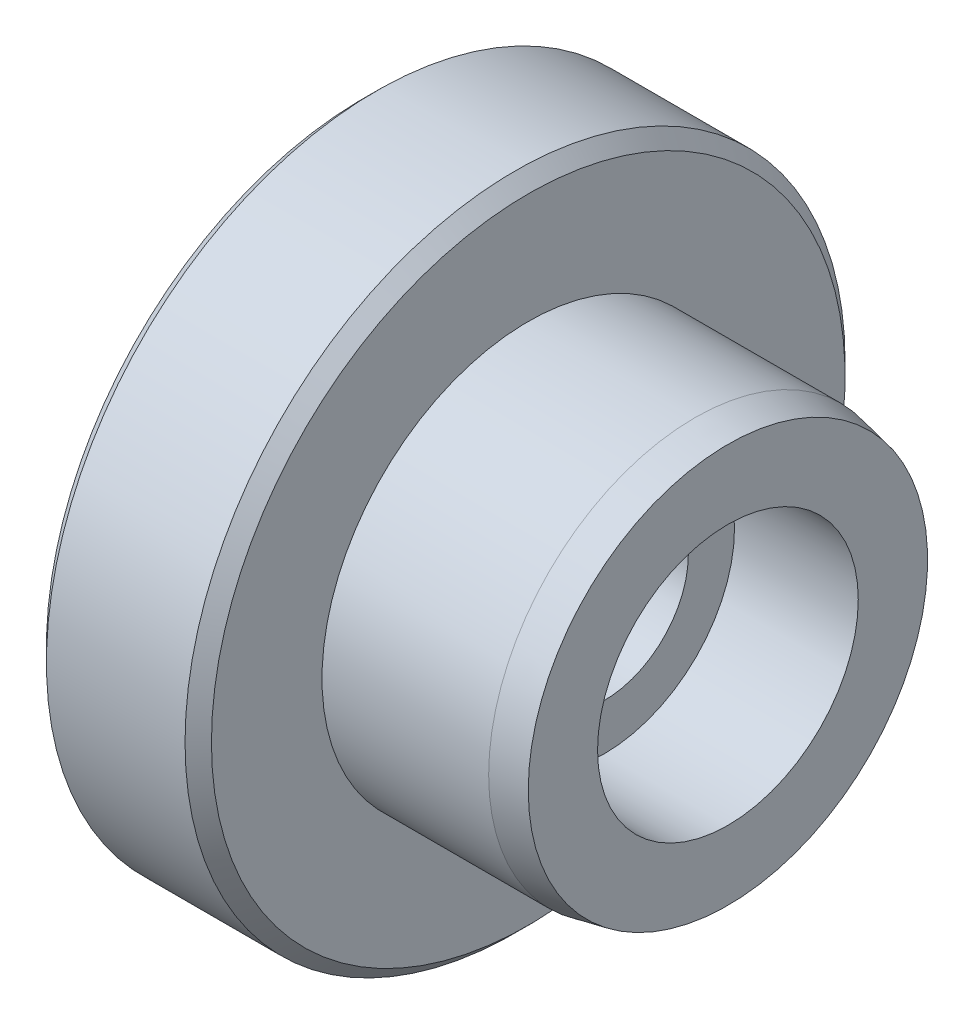
ISO-10303-21;
HEADER;
FILE_DESCRIPTION(('STEP AP214'),'2;1');
FILE_NAME('part.step','',(''),(''),'','','');
FILE_SCHEMA(('AUTOMOTIVE_DESIGN { 1 0 10303 214 1 1 1 1 }'));
ENDSEC;
DATA;
#1=APPLICATION_CONTEXT('core data for automotive mechanical design processes');
#2=APPLICATION_PROTOCOL_DEFINITION('international standard','automotive_design',2000,#1);
#3=PRODUCT_CONTEXT('',#1,'mechanical');
#4=PRODUCT('Part','Part','',(#3));
#5=PRODUCT_RELATED_PRODUCT_CATEGORY('part','',(#4));
#6=PRODUCT_DEFINITION_FORMATION('','',#4);
#7=PRODUCT_DEFINITION_CONTEXT('part definition',#1,'design');
#8=PRODUCT_DEFINITION('design','',#6,#7);
#9=PRODUCT_DEFINITION_SHAPE('','',#8);
#10=(LENGTH_UNIT() NAMED_UNIT(*) SI_UNIT(.MILLI.,.METRE.));
#11=(NAMED_UNIT(*) PLANE_ANGLE_UNIT() SI_UNIT($,.RADIAN.));
#12=(NAMED_UNIT(*) SI_UNIT($,.STERADIAN.) SOLID_ANGLE_UNIT());
#13=UNCERTAINTY_MEASURE_WITH_UNIT(LENGTH_MEASURE(1.E-05),#10,'distance_accuracy_value','');
#14=(GEOMETRIC_REPRESENTATION_CONTEXT(3) GLOBAL_UNCERTAINTY_ASSIGNED_CONTEXT((#13)) GLOBAL_UNIT_ASSIGNED_CONTEXT((#10,
#11,#12)) REPRESENTATION_CONTEXT('',''));
#15=CARTESIAN_POINT('',(0.,0.,0.));
#16=DIRECTION('',(0.,0.,1.));
#17=DIRECTION('',(1.,0.,0.));
#18=AXIS2_PLACEMENT_3D('',#15,#16,#17);
#19=CARTESIAN_POINT('',(12.446,3.2385,0.));
#20=DIRECTION('',(1.,0.,0.));
#21=DIRECTION('',(0.,0.,-1.));
#22=AXIS2_PLACEMENT_3D('',#19,#20,#21);
#23=PLANE('',#22);
#24=CARTESIAN_POINT('',(12.446,0.,0.));
#25=DIRECTION('',(1.,0.,0.));
#26=DIRECTION('',(0.,0.,-1.));
#27=AXIS2_PLACEMENT_3D('',#24,#25,#26);
#28=CIRCLE('',#27,3.2385);
#29=CARTESIAN_POINT('',(12.446,0.,-3.2385));
#30=VERTEX_POINT('',#29);
#31=EDGE_CURVE('E60',#30,#30,#28,.F.);
#32=ORIENTED_EDGE('',*,*,#31,.T.);
#33=EDGE_LOOP('',(#32));
#34=FACE_BOUND('',#33,.T.);
#35=CARTESIAN_POINT('',(12.446,0.,0.));
#36=DIRECTION('',(1.,0.,0.));
#37=DIRECTION('',(0.,0.,-1.));
#38=AXIS2_PLACEMENT_3D('',#35,#36,#37);
#39=CIRCLE('',#38,5.0165);
#40=CARTESIAN_POINT('',(12.446,0.,-5.0165));
#41=VERTEX_POINT('',#40);
#42=EDGE_CURVE('E17',#41,#41,#39,.T.);
#43=ORIENTED_EDGE('',*,*,#42,.T.);
#44=EDGE_LOOP('',(#43));
#45=FACE_BOUND('',#44,.T.);
#46=ADVANCED_FACE('F14',(#34,#45),#23,.T.);
#47=CARTESIAN_POINT('',(14.82725,0.,0.));
#48=DIRECTION('',(1.,0.,0.));
#49=DIRECTION('',(0.,0.,-1.));
#50=AXIS2_PLACEMENT_3D('',#47,#48,#49);
#51=CYLINDRICAL_SURFACE('',#50,5.0165);
#52=CARTESIAN_POINT('',(17.2085,0.,0.));
#53=DIRECTION('',(1.,0.,0.));
#54=DIRECTION('',(0.,0.,-1.));
#55=AXIS2_PLACEMENT_3D('',#52,#53,#54);
#56=CIRCLE('',#55,5.0165);
#57=CARTESIAN_POINT('',(17.2085,0.,-5.0165));
#58=VERTEX_POINT('',#57);
#59=EDGE_CURVE('E58',#58,#58,#56,.F.);
#60=ORIENTED_EDGE('',*,*,#59,.F.);
#61=EDGE_LOOP('',(#60));
#62=FACE_BOUND('',#61,.T.);
#63=ORIENTED_EDGE('',*,*,#42,.F.);
#64=EDGE_LOOP('',(#63));
#65=FACE_BOUND('',#64,.T.);
#66=ADVANCED_FACE('F68',(#62,#65),#51,.F.);
#67=CARTESIAN_POINT('',(6.223,0.,0.));
#68=DIRECTION('',(1.,0.,0.));
#69=DIRECTION('',(0.,0.,-1.));
#70=AXIS2_PLACEMENT_3D('',#67,#68,#69);
#71=CYLINDRICAL_SURFACE('',#70,3.2385);
#72=ORIENTED_EDGE('',*,*,#31,.F.);
#73=EDGE_LOOP('',(#72));
#74=FACE_BOUND('',#73,.T.);
#75=CARTESIAN_POINT('',(0.,0.,0.));
#76=DIRECTION('',(1.,0.,0.));
#77=DIRECTION('',(0.,0.,-1.));
#78=AXIS2_PLACEMENT_3D('',#75,#76,#77);
#79=CIRCLE('',#78,3.2385);
#80=CARTESIAN_POINT('',(0.,0.,-3.2385));
#81=VERTEX_POINT('',#80);
#82=EDGE_CURVE('E55',#81,#81,#79,.T.);
#83=ORIENTED_EDGE('',*,*,#82,.F.);
#84=EDGE_LOOP('',(#83));
#85=FACE_BOUND('',#84,.T.);
#86=ADVANCED_FACE('F70',(#74,#85),#71,.F.);
#87=CARTESIAN_POINT('',(17.2085,5.0165,0.));
#88=DIRECTION('',(1.,0.,0.));
#89=DIRECTION('',(0.,0.,-1.));
#90=AXIS2_PLACEMENT_3D('',#87,#88,#89);
#91=PLANE('',#90);
#92=ORIENTED_EDGE('',*,*,#59,.T.);
#93=EDGE_LOOP('',(#92));
#94=FACE_BOUND('',#93,.T.);
#95=CARTESIAN_POINT('',(17.2084999999999,0.,0.));
#96=DIRECTION('',(-1.,0.,0.));
#97=DIRECTION('',(0.,0.,1.));
#98=AXIS2_PLACEMENT_3D('',#95,#96,#97);
#99=CIRCLE('',#98,7.68349999999959);
#100=CARTESIAN_POINT('',(17.2084999999999,0.,7.68349999999959));
#101=VERTEX_POINT('',#100);
#102=EDGE_CURVE('E52',#101,#101,#99,.T.);
#103=ORIENTED_EDGE('',*,*,#102,.F.);
#104=EDGE_LOOP('',(#103));
#105=FACE_BOUND('',#104,.T.);
#106=ADVANCED_FACE('F77',(#94,#105),#91,.T.);
#107=CARTESIAN_POINT('',(0.,4.7625,0.));
#108=DIRECTION('',(-1.,0.,0.));
#109=DIRECTION('',(0.,0.,1.));
#110=AXIS2_PLACEMENT_3D('',#107,#108,#109);
#111=PLANE('',#110);
#112=ORIENTED_EDGE('',*,*,#82,.T.);
#113=EDGE_LOOP('',(#112));
#114=FACE_BOUND('',#113,.T.);
#115=CARTESIAN_POINT('',(0.,0.,0.));
#116=DIRECTION('',(1.,0.,0.));
#117=DIRECTION('',(0.,0.,-1.));
#118=AXIS2_PLACEMENT_3D('',#115,#116,#117);
#119=CIRCLE('',#118,4.7624999999698);
#120=CARTESIAN_POINT('',(0.,0.,-4.7624999999698));
#121=VERTEX_POINT('',#120);
#122=EDGE_CURVE('E37',#121,#121,#119,.T.);
#123=ORIENTED_EDGE('',*,*,#122,.F.);
#124=EDGE_LOOP('',(#123));
#125=FACE_BOUND('',#124,.T.);
#126=ADVANCED_FACE('F115',(#114,#125),#111,.T.);
#127=CARTESIAN_POINT('',(15.9385000000001,0.,0.));
#128=DIRECTION('',(-1.,0.,0.));
#129=DIRECTION('',(0.,0.,1.));
#130=AXIS2_PLACEMENT_3D('',#127,#128,#129);
#131=CONICAL_SURFACE('',#130,7.93750000000041,0.197395559850522);
#132=CARTESIAN_POINT('',(15.9385,0.,0.));
#133=DIRECTION('',(1.,0.,0.));
#134=DIRECTION('',(0.,0.,-1.));
#135=AXIS2_PLACEMENT_3D('',#132,#133,#134);
#136=CIRCLE('',#135,7.9375);
#137=CARTESIAN_POINT('',(15.9385,0.,-7.9375));
#138=VERTEX_POINT('',#137);
#139=EDGE_CURVE('E33',#138,#138,#136,.F.);
#140=ORIENTED_EDGE('',*,*,#139,.F.);
#141=EDGE_LOOP('',(#140));
#142=FACE_BOUND('',#141,.T.);
#143=ORIENTED_EDGE('',*,*,#102,.T.);
#144=EDGE_LOOP('',(#143));
#145=FACE_BOUND('',#144,.T.);
#146=ADVANCED_FACE('F111',(#142,#145),#131,.T.);
#147=CARTESIAN_POINT('',(3.17499999994197,0.,0.));
#148=DIRECTION('',(1.,0.,0.));
#149=DIRECTION('',(0.,0.,-1.));
#150=AXIS2_PLACEMENT_3D('',#147,#148,#149);
#151=CONICAL_SURFACE('',#150,7.93749999991178,0.785398163397448);
#152=ORIENTED_EDGE('',*,*,#122,.T.);
#153=EDGE_LOOP('',(#152));
#154=FACE_BOUND('',#153,.T.);
#155=CARTESIAN_POINT('',(3.17499999999882,0.,0.));
#156=DIRECTION('',(1.,0.,0.));
#157=DIRECTION('',(0.,0.,-1.));
#158=AXIS2_PLACEMENT_3D('',#155,#156,#157);
#159=CIRCLE('',#158,7.93749999996862);
#160=CARTESIAN_POINT('',(3.17499999999882,0.,-7.93749999996862));
#161=VERTEX_POINT('',#160);
#162=EDGE_CURVE('E36',#161,#161,#159,.T.);
#163=ORIENTED_EDGE('',*,*,#162,.F.);
#164=EDGE_LOOP('',(#163));
#165=FACE_BOUND('',#164,.T.);
#166=ADVANCED_FACE('F107',(#154,#165),#151,.T.);
#167=CARTESIAN_POINT('',(12.73175,0.,0.));
#168=DIRECTION('',(1.,0.,0.));
#169=DIRECTION('',(0.,0.,-1.));
#170=AXIS2_PLACEMENT_3D('',#167,#168,#169);
#171=CYLINDRICAL_SURFACE('',#170,7.9375);
#172=CARTESIAN_POINT('',(9.525,0.,0.));
#173=DIRECTION('',(1.,0.,0.));
#174=DIRECTION('',(0.,0.,-1.));
#175=AXIS2_PLACEMENT_3D('',#172,#173,#174);
#176=CIRCLE('',#175,7.9375);
#177=CARTESIAN_POINT('',(9.525,0.,-7.9375));
#178=VERTEX_POINT('',#177);
#179=EDGE_CURVE('E45',#178,#178,#176,.F.);
#180=ORIENTED_EDGE('',*,*,#179,.F.);
#181=EDGE_LOOP('',(#180));
#182=FACE_BOUND('',#181,.T.);
#183=ORIENTED_EDGE('',*,*,#139,.T.);
#184=EDGE_LOOP('',(#183));
#185=FACE_BOUND('',#184,.T.);
#186=ADVANCED_FACE('F103',(#182,#185),#171,.T.);
#187=CARTESIAN_POINT('',(3.175,12.7,0.));
#188=DIRECTION('',(-1.,0.,0.));
#189=DIRECTION('',(0.,0.,1.));
#190=AXIS2_PLACEMENT_3D('',#187,#188,#189);
#191=PLANE('',#190);
#192=ORIENTED_EDGE('',*,*,#162,.T.);
#193=EDGE_LOOP('',(#192));
#194=FACE_BOUND('',#193,.T.);
#195=CARTESIAN_POINT('',(3.17500000000065,0.,0.));
#196=DIRECTION('',(1.,0.,0.));
#197=DIRECTION('',(0.,0.,-1.));
#198=AXIS2_PLACEMENT_3D('',#195,#196,#197);
#199=CIRCLE('',#198,12.1919999999994);
#200=CARTESIAN_POINT('',(3.17500000000065,0.,-12.1919999999994));
#201=VERTEX_POINT('',#200);
#202=EDGE_CURVE('E42',#201,#201,#199,.T.);
#203=ORIENTED_EDGE('',*,*,#202,.F.);
#204=EDGE_LOOP('',(#203));
#205=FACE_BOUND('',#204,.T.);
#206=ADVANCED_FACE('F99',(#194,#205),#191,.T.);
#207=CARTESIAN_POINT('',(9.525,7.9375,0.));
#208=DIRECTION('',(1.,0.,0.));
#209=DIRECTION('',(0.,0.,-1.));
#210=AXIS2_PLACEMENT_3D('',#207,#208,#209);
#211=PLANE('',#210);
#212=ORIENTED_EDGE('',*,*,#179,.T.);
#213=EDGE_LOOP('',(#212));
#214=FACE_BOUND('',#213,.T.);
#215=CARTESIAN_POINT('',(9.52499999999935,0.,0.));
#216=DIRECTION('',(-1.,0.,0.));
#217=DIRECTION('',(0.,0.,1.));
#218=AXIS2_PLACEMENT_3D('',#215,#216,#217);
#219=CIRCLE('',#218,12.1919999999994);
#220=CARTESIAN_POINT('',(9.52499999999935,0.,12.1919999999994));
#221=VERTEX_POINT('',#220);
#222=EDGE_CURVE('E26',#221,#221,#219,.T.);
#223=ORIENTED_EDGE('',*,*,#222,.F.);
#224=EDGE_LOOP('',(#223));
#225=FACE_BOUND('',#224,.T.);
#226=ADVANCED_FACE('F95',(#214,#225),#211,.T.);
#227=CARTESIAN_POINT('',(3.68299999999935,0.,0.));
#228=DIRECTION('',(1.,0.,0.));
#229=DIRECTION('',(0.,0.,-1.));
#230=AXIS2_PLACEMENT_3D('',#227,#228,#229);
#231=CONICAL_SURFACE('',#230,12.7000000000006,0.7853981634);
#232=CARTESIAN_POINT('',(3.683,0.,0.));
#233=DIRECTION('',(1.,0.,0.));
#234=DIRECTION('',(0.,0.,-1.));
#235=AXIS2_PLACEMENT_3D('',#232,#233,#234);
#236=CIRCLE('',#235,12.7);
#237=CARTESIAN_POINT('',(3.683,0.,-12.7));
#238=VERTEX_POINT('',#237);
#239=EDGE_CURVE('E21',#238,#238,#236,.T.);
#240=ORIENTED_EDGE('',*,*,#239,.F.);
#241=EDGE_LOOP('',(#240));
#242=FACE_BOUND('',#241,.T.);
#243=ORIENTED_EDGE('',*,*,#202,.T.);
#244=EDGE_LOOP('',(#243));
#245=FACE_BOUND('',#244,.T.);
#246=ADVANCED_FACE('F88',(#242,#245),#231,.T.);
#247=CARTESIAN_POINT('',(9.01700000000065,0.,0.));
#248=DIRECTION('',(-1.,0.,0.));
#249=DIRECTION('',(0.,0.,1.));
#250=AXIS2_PLACEMENT_3D('',#247,#248,#249);
#251=CONICAL_SURFACE('',#250,12.7000000000006,0.785398163400001);
#252=ORIENTED_EDGE('',*,*,#222,.T.);
#253=EDGE_LOOP('',(#252));
#254=FACE_BOUND('',#253,.T.);
#255=CARTESIAN_POINT('',(9.017,0.,0.));
#256=DIRECTION('',(1.,0.,0.));
#257=DIRECTION('',(0.,0.,-1.));
#258=AXIS2_PLACEMENT_3D('',#255,#256,#257);
#259=CIRCLE('',#258,12.7);
#260=CARTESIAN_POINT('',(9.017,0.,-12.7));
#261=VERTEX_POINT('',#260);
#262=EDGE_CURVE('E9',#261,#261,#259,.F.);
#263=ORIENTED_EDGE('',*,*,#262,.F.);
#264=EDGE_LOOP('',(#263));
#265=FACE_BOUND('',#264,.T.);
#266=ADVANCED_FACE('F83',(#254,#265),#251,.T.);
#267=CARTESIAN_POINT('',(6.35,0.,0.));
#268=DIRECTION('',(1.,0.,0.));
#269=DIRECTION('',(0.,0.,-1.));
#270=AXIS2_PLACEMENT_3D('',#267,#268,#269);
#271=CYLINDRICAL_SURFACE('',#270,12.7);
#272=ORIENTED_EDGE('',*,*,#262,.T.);
#273=EDGE_LOOP('',(#272));
#274=FACE_BOUND('',#273,.T.);
#275=ORIENTED_EDGE('',*,*,#239,.T.);
#276=EDGE_LOOP('',(#275));
#277=FACE_BOUND('',#276,.T.);
#278=ADVANCED_FACE('F81',(#274,#277),#271,.T.);
#279=CLOSED_SHELL('',(#46,#66,#86,#106,#126,#146,#166,#186,#206,#226,#246,#266,#278));
#280=MANIFOLD_SOLID_BREP('B1',#279);
#281=ADVANCED_BREP_SHAPE_REPRESENTATION('',(#18,#280),#14);
#282=SHAPE_DEFINITION_REPRESENTATION(#9,#281);
ENDSEC;
END-ISO-10303-21;
